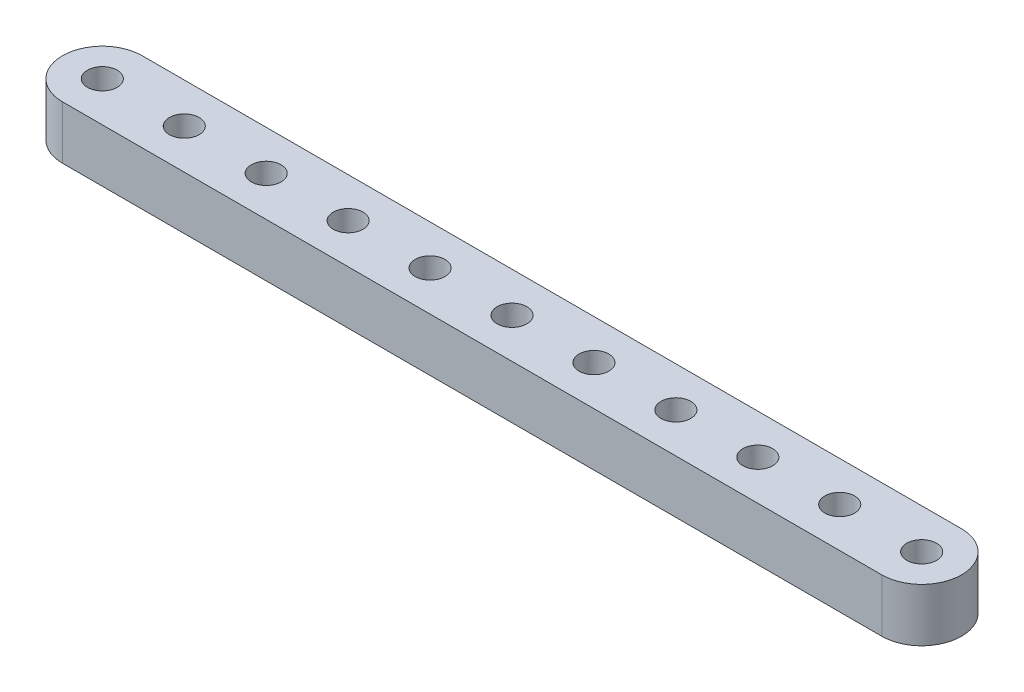
ISO-10303-21;
HEADER;
FILE_DESCRIPTION(('STEP AP214'),'2;1');
FILE_NAME('part.step','',(''),(''),'','','');
FILE_SCHEMA(('AUTOMOTIVE_DESIGN { 1 0 10303 214 1 1 1 1 }'));
ENDSEC;
DATA;
#1=APPLICATION_CONTEXT('core data for automotive mechanical design processes');
#2=APPLICATION_PROTOCOL_DEFINITION('international standard','automotive_design',2000,#1);
#3=PRODUCT_CONTEXT('',#1,'mechanical');
#4=PRODUCT('Part','Part','',(#3));
#5=PRODUCT_RELATED_PRODUCT_CATEGORY('part','',(#4));
#6=PRODUCT_DEFINITION_FORMATION('','',#4);
#7=PRODUCT_DEFINITION_CONTEXT('part definition',#1,'design');
#8=PRODUCT_DEFINITION('design','',#6,#7);
#9=PRODUCT_DEFINITION_SHAPE('','',#8);
#10=(LENGTH_UNIT() NAMED_UNIT(*) SI_UNIT(.MILLI.,.METRE.));
#11=(NAMED_UNIT(*) PLANE_ANGLE_UNIT() SI_UNIT($,.RADIAN.));
#12=(NAMED_UNIT(*) SI_UNIT($,.STERADIAN.) SOLID_ANGLE_UNIT());
#13=UNCERTAINTY_MEASURE_WITH_UNIT(LENGTH_MEASURE(1.E-05),#10,'distance_accuracy_value','');
#14=(GEOMETRIC_REPRESENTATION_CONTEXT(3) GLOBAL_UNCERTAINTY_ASSIGNED_CONTEXT((#13)) GLOBAL_UNIT_ASSIGNED_CONTEXT((#10,
#11,#12)) REPRESENTATION_CONTEXT('',''));
#15=CARTESIAN_POINT('',(0.,0.,0.));
#16=DIRECTION('',(0.,0.,1.));
#17=DIRECTION('',(1.,0.,0.));
#18=AXIS2_PLACEMENT_3D('',#15,#16,#17);
#19=CARTESIAN_POINT('',(-48.895,6.35,0.));
#20=DIRECTION('',(0.,-1.,0.));
#21=DIRECTION('',(0.,0.,-1.));
#22=AXIS2_PLACEMENT_3D('',#19,#20,#21);
#23=CYLINDRICAL_SURFACE('',#22,4.76250000000001);
#24=CARTESIAN_POINT('',(-48.895,0.,0.));
#25=DIRECTION('',(0.,-1.,0.));
#26=DIRECTION('',(0.,0.,-1.));
#27=AXIS2_PLACEMENT_3D('',#24,#25,#26);
#28=CIRCLE('',#27,4.76250000000001);
#29=CARTESIAN_POINT('',(-48.895,0.,4.76250000000001));
#30=VERTEX_POINT('',#29);
#31=CARTESIAN_POINT('',(-48.895,0.,-4.76250000000001));
#32=VERTEX_POINT('',#31);
#33=EDGE_CURVE('E98',#30,#32,#28,.T.);
#34=ORIENTED_EDGE('',*,*,#33,.F.);
#35=DIRECTION('',(0.,-1.,0.));
#36=VECTOR('',#35,1.);
#37=CARTESIAN_POINT('',(-48.895,6.35,4.76250000000001));
#38=LINE('',#37,#36);
#39=CARTESIAN_POINT('',(-48.895,6.35,4.76250000000001));
#40=VERTEX_POINT('',#39);
#41=EDGE_CURVE('E11',#40,#30,#38,.T.);
#42=ORIENTED_EDGE('',*,*,#41,.F.);
#43=CARTESIAN_POINT('',(-48.895,6.35,0.));
#44=DIRECTION('',(0.,-1.,0.));
#45=DIRECTION('',(0.,0.,-1.));
#46=AXIS2_PLACEMENT_3D('',#43,#44,#45);
#47=CIRCLE('',#46,4.76250000000001);
#48=CARTESIAN_POINT('',(-48.895,6.35,-4.76250000000001));
#49=VERTEX_POINT('',#48);
#50=EDGE_CURVE('E91',#40,#49,#47,.T.);
#51=ORIENTED_EDGE('',*,*,#50,.T.);
#52=DIRECTION('',(0.,-1.,0.));
#53=VECTOR('',#52,1.);
#54=CARTESIAN_POINT('',(-48.895,6.35,-4.76250000000001));
#55=LINE('',#54,#53);
#56=EDGE_CURVE('E36',#49,#32,#55,.T.);
#57=ORIENTED_EDGE('',*,*,#56,.T.);
#58=EDGE_LOOP('',(#34,#42,#51,#57));
#59=FACE_BOUND('',#58,.T.);
#60=ADVANCED_FACE('F33',(#59),#23,.T.);
#61=CARTESIAN_POINT('',(48.895,6.35,4.76250000000001));
#62=DIRECTION('',(0.,0.,1.));
#63=DIRECTION('',(1.,0.,0.));
#64=AXIS2_PLACEMENT_3D('',#61,#62,#63);
#65=PLANE('',#64);
#66=DIRECTION('',(-1.,0.,0.));
#67=VECTOR('',#66,1.);
#68=CARTESIAN_POINT('',(48.895,0.,4.76250000000001));
#69=LINE('',#68,#67);
#70=CARTESIAN_POINT('',(48.895,0.,4.76250000000002));
#71=VERTEX_POINT('',#70);
#72=EDGE_CURVE('E93',#71,#30,#69,.T.);
#73=ORIENTED_EDGE('',*,*,#72,.F.);
#74=DIRECTION('',(0.,-1.,0.));
#75=VECTOR('',#74,1.);
#76=CARTESIAN_POINT('',(48.895,6.35,4.76250000000002));
#77=LINE('',#76,#75);
#78=CARTESIAN_POINT('',(48.895,6.35,4.76250000000002));
#79=VERTEX_POINT('',#78);
#80=EDGE_CURVE('E42',#79,#71,#77,.T.);
#81=ORIENTED_EDGE('',*,*,#80,.F.);
#82=DIRECTION('',(-1.,0.,0.));
#83=VECTOR('',#82,1.);
#84=CARTESIAN_POINT('',(48.895,6.35,4.76250000000001));
#85=LINE('',#84,#83);
#86=EDGE_CURVE('E88',#79,#40,#85,.T.);
#87=ORIENTED_EDGE('',*,*,#86,.T.);
#88=ORIENTED_EDGE('',*,*,#41,.T.);
#89=EDGE_LOOP('',(#73,#81,#87,#88));
#90=FACE_BOUND('',#89,.T.);
#91=ADVANCED_FACE('F109',(#90),#65,.T.);
#92=CARTESIAN_POINT('',(48.895,6.35,0.));
#93=DIRECTION('',(0.,-1.,0.));
#94=DIRECTION('',(0.,0.,-1.));
#95=AXIS2_PLACEMENT_3D('',#92,#93,#94);
#96=CYLINDRICAL_SURFACE('',#95,4.76250000000001);
#97=CARTESIAN_POINT('',(48.895,0.,0.));
#98=DIRECTION('',(0.,-1.,0.));
#99=DIRECTION('',(0.,0.,-1.));
#100=AXIS2_PLACEMENT_3D('',#97,#98,#99);
#101=CIRCLE('',#100,4.76250000000001);
#102=CARTESIAN_POINT('',(48.895,0.,-4.76250000000001));
#103=VERTEX_POINT('',#102);
#104=EDGE_CURVE('E83',#103,#71,#101,.T.);
#105=ORIENTED_EDGE('',*,*,#104,.F.);
#106=DIRECTION('',(0.,-1.,0.));
#107=VECTOR('',#106,1.);
#108=CARTESIAN_POINT('',(48.895,6.35,-4.76250000000001));
#109=LINE('',#108,#107);
#110=CARTESIAN_POINT('',(48.895,6.35,-4.76250000000001));
#111=VERTEX_POINT('',#110);
#112=EDGE_CURVE('E78',#111,#103,#109,.T.);
#113=ORIENTED_EDGE('',*,*,#112,.F.);
#114=CARTESIAN_POINT('',(48.895,6.35,0.));
#115=DIRECTION('',(0.,-1.,0.));
#116=DIRECTION('',(0.,0.,-1.));
#117=AXIS2_PLACEMENT_3D('',#114,#115,#116);
#118=CIRCLE('',#117,4.76250000000001);
#119=EDGE_CURVE('E81',#111,#79,#118,.T.);
#120=ORIENTED_EDGE('',*,*,#119,.T.);
#121=ORIENTED_EDGE('',*,*,#80,.T.);
#122=EDGE_LOOP('',(#105,#113,#120,#121));
#123=FACE_BOUND('',#122,.T.);
#124=ADVANCED_FACE('F80',(#123),#96,.T.);
#125=CARTESIAN_POINT('',(-48.895,6.35,-4.76250000000001));
#126=DIRECTION('',(0.,0.,-1.));
#127=DIRECTION('',(-1.,0.,0.));
#128=AXIS2_PLACEMENT_3D('',#125,#126,#127);
#129=PLANE('',#128);
#130=DIRECTION('',(1.,0.,0.));
#131=VECTOR('',#130,1.);
#132=CARTESIAN_POINT('',(-48.895,0.,-4.76250000000001));
#133=LINE('',#132,#131);
#134=EDGE_CURVE('E101',#32,#103,#133,.T.);
#135=ORIENTED_EDGE('',*,*,#134,.F.);
#136=ORIENTED_EDGE('',*,*,#56,.F.);
#137=DIRECTION('',(1.,0.,0.));
#138=VECTOR('',#137,1.);
#139=CARTESIAN_POINT('',(-48.895,6.35,-4.76250000000001));
#140=LINE('',#139,#138);
#141=EDGE_CURVE('E87',#49,#111,#140,.T.);
#142=ORIENTED_EDGE('',*,*,#141,.T.);
#143=ORIENTED_EDGE('',*,*,#112,.T.);
#144=EDGE_LOOP('',(#135,#136,#142,#143));
#145=FACE_BOUND('',#144,.T.);
#146=ADVANCED_FACE('F90',(#145),#129,.T.);
#147=CARTESIAN_POINT('',(-48.895,6.35,0.));
#148=DIRECTION('',(0.,-1.,0.));
#149=DIRECTION('',(0.,0.,-1.));
#150=AXIS2_PLACEMENT_3D('',#147,#148,#149);
#151=PLANE('',#150);
#152=CARTESIAN_POINT('',(-48.895,6.35,0.));
#153=DIRECTION('',(0.,-1.,0.));
#154=DIRECTION('',(0.,0.,1.));
#155=AXIS2_PLACEMENT_3D('',#152,#153,#154);
#156=CIRCLE('',#155,1.77799999999998);
#157=CARTESIAN_POINT('',(-48.895,6.35,1.77799999999999));
#158=VERTEX_POINT('',#157);
#159=EDGE_CURVE('E178',#158,#158,#156,.T.);
#160=ORIENTED_EDGE('',*,*,#159,.T.);
#161=EDGE_LOOP('',(#160));
#162=FACE_BOUND('',#161,.T.);
#163=CARTESIAN_POINT('',(-39.116,6.35,0.));
#164=DIRECTION('',(0.,-1.,0.));
#165=DIRECTION('',(0.,0.,1.));
#166=AXIS2_PLACEMENT_3D('',#163,#164,#165);
#167=CIRCLE('',#166,1.77799999999999);
#168=CARTESIAN_POINT('',(-39.116,6.35,1.77799999999999));
#169=VERTEX_POINT('',#168);
#170=EDGE_CURVE('E186',#169,#169,#167,.T.);
#171=ORIENTED_EDGE('',*,*,#170,.T.);
#172=EDGE_LOOP('',(#171));
#173=FACE_BOUND('',#172,.T.);
#174=CARTESIAN_POINT('',(-29.337,6.35,0.));
#175=DIRECTION('',(0.,-1.,0.));
#176=DIRECTION('',(0.,0.,1.));
#177=AXIS2_PLACEMENT_3D('',#174,#175,#176);
#178=CIRCLE('',#177,1.77799999999999);
#179=CARTESIAN_POINT('',(-29.337,6.35,1.77799999999999));
#180=VERTEX_POINT('',#179);
#181=EDGE_CURVE('E192',#180,#180,#178,.T.);
#182=ORIENTED_EDGE('',*,*,#181,.T.);
#183=EDGE_LOOP('',(#182));
#184=FACE_BOUND('',#183,.T.);
#185=CARTESIAN_POINT('',(-19.558,6.35,0.));
#186=DIRECTION('',(0.,-1.,0.));
#187=DIRECTION('',(0.,0.,1.));
#188=AXIS2_PLACEMENT_3D('',#185,#186,#187);
#189=CIRCLE('',#188,1.77799999999999);
#190=CARTESIAN_POINT('',(-19.558,6.35,1.77799999999999));
#191=VERTEX_POINT('',#190);
#192=EDGE_CURVE('E198',#191,#191,#189,.T.);
#193=ORIENTED_EDGE('',*,*,#192,.T.);
#194=EDGE_LOOP('',(#193));
#195=FACE_BOUND('',#194,.T.);
#196=CARTESIAN_POINT('',(-9.779,6.35,0.));
#197=DIRECTION('',(0.,-1.,0.));
#198=DIRECTION('',(0.,0.,1.));
#199=AXIS2_PLACEMENT_3D('',#196,#197,#198);
#200=CIRCLE('',#199,1.77799999999999);
#201=CARTESIAN_POINT('',(-9.779,6.35,1.77799999999999));
#202=VERTEX_POINT('',#201);
#203=EDGE_CURVE('E204',#202,#202,#200,.T.);
#204=ORIENTED_EDGE('',*,*,#203,.T.);
#205=EDGE_LOOP('',(#204));
#206=FACE_BOUND('',#205,.T.);
#207=CARTESIAN_POINT('',(0.,6.35,0.));
#208=DIRECTION('',(0.,-1.,0.));
#209=DIRECTION('',(0.,0.,1.));
#210=AXIS2_PLACEMENT_3D('',#207,#208,#209);
#211=CIRCLE('',#210,1.77799999999999);
#212=CARTESIAN_POINT('',(0.,6.35,1.77799999999999));
#213=VERTEX_POINT('',#212);
#214=EDGE_CURVE('E210',#213,#213,#211,.T.);
#215=ORIENTED_EDGE('',*,*,#214,.T.);
#216=EDGE_LOOP('',(#215));
#217=FACE_BOUND('',#216,.T.);
#218=CARTESIAN_POINT('',(9.779,6.35,0.));
#219=DIRECTION('',(0.,-1.,0.));
#220=DIRECTION('',(0.,0.,1.));
#221=AXIS2_PLACEMENT_3D('',#218,#219,#220);
#222=CIRCLE('',#221,1.77799999999999);
#223=CARTESIAN_POINT('',(9.779,6.35,1.77799999999999));
#224=VERTEX_POINT('',#223);
#225=EDGE_CURVE('E216',#224,#224,#222,.T.);
#226=ORIENTED_EDGE('',*,*,#225,.T.);
#227=EDGE_LOOP('',(#226));
#228=FACE_BOUND('',#227,.T.);
#229=CARTESIAN_POINT('',(19.558,6.35,0.));
#230=DIRECTION('',(0.,-1.,0.));
#231=DIRECTION('',(0.,0.,1.));
#232=AXIS2_PLACEMENT_3D('',#229,#230,#231);
#233=CIRCLE('',#232,1.77799999999999);
#234=CARTESIAN_POINT('',(19.558,6.35,1.77799999999999));
#235=VERTEX_POINT('',#234);
#236=EDGE_CURVE('E222',#235,#235,#233,.T.);
#237=ORIENTED_EDGE('',*,*,#236,.T.);
#238=EDGE_LOOP('',(#237));
#239=FACE_BOUND('',#238,.T.);
#240=CARTESIAN_POINT('',(29.337,6.35,0.));
#241=DIRECTION('',(0.,-1.,0.));
#242=DIRECTION('',(0.,0.,1.));
#243=AXIS2_PLACEMENT_3D('',#240,#241,#242);
#244=CIRCLE('',#243,1.77799999999999);
#245=CARTESIAN_POINT('',(29.337,6.35,1.77799999999999));
#246=VERTEX_POINT('',#245);
#247=EDGE_CURVE('E228',#246,#246,#244,.T.);
#248=ORIENTED_EDGE('',*,*,#247,.T.);
#249=EDGE_LOOP('',(#248));
#250=FACE_BOUND('',#249,.T.);
#251=CARTESIAN_POINT('',(39.116,6.35,0.));
#252=DIRECTION('',(0.,-1.,0.));
#253=DIRECTION('',(0.,0.,1.));
#254=AXIS2_PLACEMENT_3D('',#251,#252,#253);
#255=CIRCLE('',#254,1.77799999999999);
#256=CARTESIAN_POINT('',(39.116,6.35,1.778));
#257=VERTEX_POINT('',#256);
#258=EDGE_CURVE('E234',#257,#257,#255,.T.);
#259=ORIENTED_EDGE('',*,*,#258,.T.);
#260=EDGE_LOOP('',(#259));
#261=FACE_BOUND('',#260,.T.);
#262=CARTESIAN_POINT('',(48.895,6.35,0.));
#263=DIRECTION('',(0.,-1.,0.));
#264=DIRECTION('',(0.,0.,1.));
#265=AXIS2_PLACEMENT_3D('',#262,#263,#264);
#266=CIRCLE('',#265,1.77799999999999);
#267=CARTESIAN_POINT('',(48.895,6.35,1.778));
#268=VERTEX_POINT('',#267);
#269=EDGE_CURVE('E102',#268,#268,#266,.T.);
#270=ORIENTED_EDGE('',*,*,#269,.T.);
#271=EDGE_LOOP('',(#270));
#272=FACE_BOUND('',#271,.T.);
#273=ORIENTED_EDGE('',*,*,#50,.F.);
#274=ORIENTED_EDGE('',*,*,#86,.F.);
#275=ORIENTED_EDGE('',*,*,#119,.F.);
#276=ORIENTED_EDGE('',*,*,#141,.F.);
#277=EDGE_LOOP('',(#273,#274,#275,#276));
#278=FACE_BOUND('',#277,.T.);
#279=ADVANCED_FACE('F86',(#162,#173,#184,#195,#206,#217,#228,#239,#250,#261,#272,#278),#151,.F.);
#280=CARTESIAN_POINT('',(-48.895,0.,0.));
#281=DIRECTION('',(0.,-1.,0.));
#282=DIRECTION('',(0.,0.,-1.));
#283=AXIS2_PLACEMENT_3D('',#280,#281,#282);
#284=PLANE('',#283);
#285=CARTESIAN_POINT('',(-48.895,0.,0.));
#286=DIRECTION('',(0.,-1.,0.));
#287=DIRECTION('',(0.,0.,1.));
#288=AXIS2_PLACEMENT_3D('',#285,#286,#287);
#289=CIRCLE('',#288,1.77799999999998);
#290=CARTESIAN_POINT('',(-48.895,0.,1.77799999999999));
#291=VERTEX_POINT('',#290);
#292=EDGE_CURVE('E181',#291,#291,#289,.T.);
#293=ORIENTED_EDGE('',*,*,#292,.F.);
#294=EDGE_LOOP('',(#293));
#295=FACE_BOUND('',#294,.T.);
#296=CARTESIAN_POINT('',(-39.116,0.,0.));
#297=DIRECTION('',(0.,-1.,0.));
#298=DIRECTION('',(0.,0.,1.));
#299=AXIS2_PLACEMENT_3D('',#296,#297,#298);
#300=CIRCLE('',#299,1.77799999999999);
#301=CARTESIAN_POINT('',(-39.116,0.,1.77799999999999));
#302=VERTEX_POINT('',#301);
#303=EDGE_CURVE('E183',#302,#302,#300,.T.);
#304=ORIENTED_EDGE('',*,*,#303,.F.);
#305=EDGE_LOOP('',(#304));
#306=FACE_BOUND('',#305,.T.);
#307=CARTESIAN_POINT('',(-29.337,0.,0.));
#308=DIRECTION('',(0.,-1.,0.));
#309=DIRECTION('',(0.,0.,1.));
#310=AXIS2_PLACEMENT_3D('',#307,#308,#309);
#311=CIRCLE('',#310,1.77799999999999);
#312=CARTESIAN_POINT('',(-29.337,0.,1.77799999999999));
#313=VERTEX_POINT('',#312);
#314=EDGE_CURVE('E189',#313,#313,#311,.T.);
#315=ORIENTED_EDGE('',*,*,#314,.F.);
#316=EDGE_LOOP('',(#315));
#317=FACE_BOUND('',#316,.T.);
#318=CARTESIAN_POINT('',(-19.558,0.,0.));
#319=DIRECTION('',(0.,-1.,0.));
#320=DIRECTION('',(0.,0.,1.));
#321=AXIS2_PLACEMENT_3D('',#318,#319,#320);
#322=CIRCLE('',#321,1.77799999999999);
#323=CARTESIAN_POINT('',(-19.558,0.,1.77799999999999));
#324=VERTEX_POINT('',#323);
#325=EDGE_CURVE('E195',#324,#324,#322,.T.);
#326=ORIENTED_EDGE('',*,*,#325,.F.);
#327=EDGE_LOOP('',(#326));
#328=FACE_BOUND('',#327,.T.);
#329=CARTESIAN_POINT('',(-9.779,0.,0.));
#330=DIRECTION('',(0.,-1.,0.));
#331=DIRECTION('',(0.,0.,1.));
#332=AXIS2_PLACEMENT_3D('',#329,#330,#331);
#333=CIRCLE('',#332,1.77799999999999);
#334=CARTESIAN_POINT('',(-9.779,0.,1.77799999999999));
#335=VERTEX_POINT('',#334);
#336=EDGE_CURVE('E201',#335,#335,#333,.T.);
#337=ORIENTED_EDGE('',*,*,#336,.F.);
#338=EDGE_LOOP('',(#337));
#339=FACE_BOUND('',#338,.T.);
#340=CARTESIAN_POINT('',(0.,0.,0.));
#341=DIRECTION('',(0.,-1.,0.));
#342=DIRECTION('',(0.,0.,1.));
#343=AXIS2_PLACEMENT_3D('',#340,#341,#342);
#344=CIRCLE('',#343,1.77799999999999);
#345=CARTESIAN_POINT('',(0.,0.,1.77799999999999));
#346=VERTEX_POINT('',#345);
#347=EDGE_CURVE('E207',#346,#346,#344,.T.);
#348=ORIENTED_EDGE('',*,*,#347,.F.);
#349=EDGE_LOOP('',(#348));
#350=FACE_BOUND('',#349,.T.);
#351=CARTESIAN_POINT('',(9.779,0.,0.));
#352=DIRECTION('',(0.,-1.,0.));
#353=DIRECTION('',(0.,0.,1.));
#354=AXIS2_PLACEMENT_3D('',#351,#352,#353);
#355=CIRCLE('',#354,1.77799999999999);
#356=CARTESIAN_POINT('',(9.779,0.,1.77799999999999));
#357=VERTEX_POINT('',#356);
#358=EDGE_CURVE('E213',#357,#357,#355,.T.);
#359=ORIENTED_EDGE('',*,*,#358,.F.);
#360=EDGE_LOOP('',(#359));
#361=FACE_BOUND('',#360,.T.);
#362=CARTESIAN_POINT('',(19.558,0.,0.));
#363=DIRECTION('',(0.,-1.,0.));
#364=DIRECTION('',(0.,0.,1.));
#365=AXIS2_PLACEMENT_3D('',#362,#363,#364);
#366=CIRCLE('',#365,1.77799999999999);
#367=CARTESIAN_POINT('',(19.558,0.,1.77799999999999));
#368=VERTEX_POINT('',#367);
#369=EDGE_CURVE('E219',#368,#368,#366,.T.);
#370=ORIENTED_EDGE('',*,*,#369,.F.);
#371=EDGE_LOOP('',(#370));
#372=FACE_BOUND('',#371,.T.);
#373=CARTESIAN_POINT('',(29.337,0.,0.));
#374=DIRECTION('',(0.,-1.,0.));
#375=DIRECTION('',(0.,0.,1.));
#376=AXIS2_PLACEMENT_3D('',#373,#374,#375);
#377=CIRCLE('',#376,1.77799999999999);
#378=CARTESIAN_POINT('',(29.337,0.,1.77799999999999));
#379=VERTEX_POINT('',#378);
#380=EDGE_CURVE('E225',#379,#379,#377,.T.);
#381=ORIENTED_EDGE('',*,*,#380,.F.);
#382=EDGE_LOOP('',(#381));
#383=FACE_BOUND('',#382,.T.);
#384=CARTESIAN_POINT('',(39.116,0.,0.));
#385=DIRECTION('',(0.,-1.,0.));
#386=DIRECTION('',(0.,0.,1.));
#387=AXIS2_PLACEMENT_3D('',#384,#385,#386);
#388=CIRCLE('',#387,1.77799999999999);
#389=CARTESIAN_POINT('',(39.116,0.,1.778));
#390=VERTEX_POINT('',#389);
#391=EDGE_CURVE('E231',#390,#390,#388,.T.);
#392=ORIENTED_EDGE('',*,*,#391,.F.);
#393=EDGE_LOOP('',(#392));
#394=FACE_BOUND('',#393,.T.);
#395=CARTESIAN_POINT('',(48.895,0.,0.));
#396=DIRECTION('',(0.,-1.,0.));
#397=DIRECTION('',(0.,0.,1.));
#398=AXIS2_PLACEMENT_3D('',#395,#396,#397);
#399=CIRCLE('',#398,1.77799999999999);
#400=CARTESIAN_POINT('',(48.895,0.,1.778));
#401=VERTEX_POINT('',#400);
#402=EDGE_CURVE('E237',#401,#401,#399,.T.);
#403=ORIENTED_EDGE('',*,*,#402,.F.);
#404=EDGE_LOOP('',(#403));
#405=FACE_BOUND('',#404,.T.);
#406=ORIENTED_EDGE('',*,*,#33,.T.);
#407=ORIENTED_EDGE('',*,*,#134,.T.);
#408=ORIENTED_EDGE('',*,*,#104,.T.);
#409=ORIENTED_EDGE('',*,*,#72,.T.);
#410=EDGE_LOOP('',(#406,#407,#408,#409));
#411=FACE_BOUND('',#410,.T.);
#412=ADVANCED_FACE('F108',(#295,#306,#317,#328,#339,#350,#361,#372,#383,#394,#405,#411),#284,.T.);
#413=CARTESIAN_POINT('',(48.895,6.35,0.));
#414=DIRECTION('',(0.,-1.,0.));
#415=DIRECTION('',(0.,0.,-1.));
#416=AXIS2_PLACEMENT_3D('',#413,#414,#415);
#417=CYLINDRICAL_SURFACE('',#416,1.77799999999999);
#418=ORIENTED_EDGE('',*,*,#269,.F.);
#419=EDGE_LOOP('',(#418));
#420=FACE_BOUND('',#419,.T.);
#421=ORIENTED_EDGE('',*,*,#402,.T.);
#422=EDGE_LOOP('',(#421));
#423=FACE_BOUND('',#422,.T.);
#424=ADVANCED_FACE('F127',(#420,#423),#417,.F.);
#425=CARTESIAN_POINT('',(39.116,6.35,0.));
#426=DIRECTION('',(0.,-1.,0.));
#427=DIRECTION('',(0.,0.,-1.));
#428=AXIS2_PLACEMENT_3D('',#425,#426,#427);
#429=CYLINDRICAL_SURFACE('',#428,1.77799999999999);
#430=ORIENTED_EDGE('',*,*,#258,.F.);
#431=EDGE_LOOP('',(#430));
#432=FACE_BOUND('',#431,.T.);
#433=ORIENTED_EDGE('',*,*,#391,.T.);
#434=EDGE_LOOP('',(#433));
#435=FACE_BOUND('',#434,.T.);
#436=ADVANCED_FACE('F134',(#432,#435),#429,.F.);
#437=CARTESIAN_POINT('',(29.337,6.35,0.));
#438=DIRECTION('',(0.,-1.,0.));
#439=DIRECTION('',(0.,0.,-1.));
#440=AXIS2_PLACEMENT_3D('',#437,#438,#439);
#441=CYLINDRICAL_SURFACE('',#440,1.77799999999999);
#442=ORIENTED_EDGE('',*,*,#247,.F.);
#443=EDGE_LOOP('',(#442));
#444=FACE_BOUND('',#443,.T.);
#445=ORIENTED_EDGE('',*,*,#380,.T.);
#446=EDGE_LOOP('',(#445));
#447=FACE_BOUND('',#446,.T.);
#448=ADVANCED_FACE('F138',(#444,#447),#441,.F.);
#449=CARTESIAN_POINT('',(19.558,6.35,0.));
#450=DIRECTION('',(0.,-1.,0.));
#451=DIRECTION('',(0.,0.,-1.));
#452=AXIS2_PLACEMENT_3D('',#449,#450,#451);
#453=CYLINDRICAL_SURFACE('',#452,1.77799999999999);
#454=ORIENTED_EDGE('',*,*,#236,.F.);
#455=EDGE_LOOP('',(#454));
#456=FACE_BOUND('',#455,.T.);
#457=ORIENTED_EDGE('',*,*,#369,.T.);
#458=EDGE_LOOP('',(#457));
#459=FACE_BOUND('',#458,.T.);
#460=ADVANCED_FACE('F142',(#456,#459),#453,.F.);
#461=CARTESIAN_POINT('',(9.779,6.35,0.));
#462=DIRECTION('',(0.,-1.,0.));
#463=DIRECTION('',(0.,0.,-1.));
#464=AXIS2_PLACEMENT_3D('',#461,#462,#463);
#465=CYLINDRICAL_SURFACE('',#464,1.77799999999999);
#466=ORIENTED_EDGE('',*,*,#225,.F.);
#467=EDGE_LOOP('',(#466));
#468=FACE_BOUND('',#467,.T.);
#469=ORIENTED_EDGE('',*,*,#358,.T.);
#470=EDGE_LOOP('',(#469));
#471=FACE_BOUND('',#470,.T.);
#472=ADVANCED_FACE('F146',(#468,#471),#465,.F.);
#473=CARTESIAN_POINT('',(0.,6.35,0.));
#474=DIRECTION('',(0.,-1.,0.));
#475=DIRECTION('',(0.,0.,-1.));
#476=AXIS2_PLACEMENT_3D('',#473,#474,#475);
#477=CYLINDRICAL_SURFACE('',#476,1.77799999999999);
#478=ORIENTED_EDGE('',*,*,#214,.F.);
#479=EDGE_LOOP('',(#478));
#480=FACE_BOUND('',#479,.T.);
#481=ORIENTED_EDGE('',*,*,#347,.T.);
#482=EDGE_LOOP('',(#481));
#483=FACE_BOUND('',#482,.T.);
#484=ADVANCED_FACE('F150',(#480,#483),#477,.F.);
#485=CARTESIAN_POINT('',(-9.779,6.35,0.));
#486=DIRECTION('',(0.,-1.,0.));
#487=DIRECTION('',(0.,0.,-1.));
#488=AXIS2_PLACEMENT_3D('',#485,#486,#487);
#489=CYLINDRICAL_SURFACE('',#488,1.77799999999999);
#490=ORIENTED_EDGE('',*,*,#203,.F.);
#491=EDGE_LOOP('',(#490));
#492=FACE_BOUND('',#491,.T.);
#493=ORIENTED_EDGE('',*,*,#336,.T.);
#494=EDGE_LOOP('',(#493));
#495=FACE_BOUND('',#494,.T.);
#496=ADVANCED_FACE('F154',(#492,#495),#489,.F.);
#497=CARTESIAN_POINT('',(-19.558,6.35,0.));
#498=DIRECTION('',(0.,-1.,0.));
#499=DIRECTION('',(0.,0.,-1.));
#500=AXIS2_PLACEMENT_3D('',#497,#498,#499);
#501=CYLINDRICAL_SURFACE('',#500,1.77799999999999);
#502=ORIENTED_EDGE('',*,*,#192,.F.);
#503=EDGE_LOOP('',(#502));
#504=FACE_BOUND('',#503,.T.);
#505=ORIENTED_EDGE('',*,*,#325,.T.);
#506=EDGE_LOOP('',(#505));
#507=FACE_BOUND('',#506,.T.);
#508=ADVANCED_FACE('F158',(#504,#507),#501,.F.);
#509=CARTESIAN_POINT('',(-29.337,6.35,0.));
#510=DIRECTION('',(0.,-1.,0.));
#511=DIRECTION('',(0.,0.,-1.));
#512=AXIS2_PLACEMENT_3D('',#509,#510,#511);
#513=CYLINDRICAL_SURFACE('',#512,1.77799999999999);
#514=ORIENTED_EDGE('',*,*,#181,.F.);
#515=EDGE_LOOP('',(#514));
#516=FACE_BOUND('',#515,.T.);
#517=ORIENTED_EDGE('',*,*,#314,.T.);
#518=EDGE_LOOP('',(#517));
#519=FACE_BOUND('',#518,.T.);
#520=ADVANCED_FACE('F162',(#516,#519),#513,.F.);
#521=CARTESIAN_POINT('',(-39.116,6.35,0.));
#522=DIRECTION('',(0.,-1.,0.));
#523=DIRECTION('',(0.,0.,-1.));
#524=AXIS2_PLACEMENT_3D('',#521,#522,#523);
#525=CYLINDRICAL_SURFACE('',#524,1.77799999999999);
#526=ORIENTED_EDGE('',*,*,#170,.F.);
#527=EDGE_LOOP('',(#526));
#528=FACE_BOUND('',#527,.T.);
#529=ORIENTED_EDGE('',*,*,#303,.T.);
#530=EDGE_LOOP('',(#529));
#531=FACE_BOUND('',#530,.T.);
#532=ADVANCED_FACE('F166',(#528,#531),#525,.F.);
#533=CARTESIAN_POINT('',(-48.895,6.35,0.));
#534=DIRECTION('',(0.,-1.,0.));
#535=DIRECTION('',(0.,0.,-1.));
#536=AXIS2_PLACEMENT_3D('',#533,#534,#535);
#537=CYLINDRICAL_SURFACE('',#536,1.77799999999998);
#538=ORIENTED_EDGE('',*,*,#159,.F.);
#539=EDGE_LOOP('',(#538));
#540=FACE_BOUND('',#539,.T.);
#541=ORIENTED_EDGE('',*,*,#292,.T.);
#542=EDGE_LOOP('',(#541));
#543=FACE_BOUND('',#542,.T.);
#544=ADVANCED_FACE('F170',(#540,#543),#537,.F.);
#545=CLOSED_SHELL('',(#60,#91,#124,#146,#279,#412,#424,#436,#448,#460,#472,#484,#496,#508,#520,
#532,#544));
#546=MANIFOLD_SOLID_BREP('B2',#545);
#547=ADVANCED_BREP_SHAPE_REPRESENTATION('',(#18,#546),#14);
#548=SHAPE_DEFINITION_REPRESENTATION(#9,#547);
ENDSEC;
END-ISO-10303-21;
